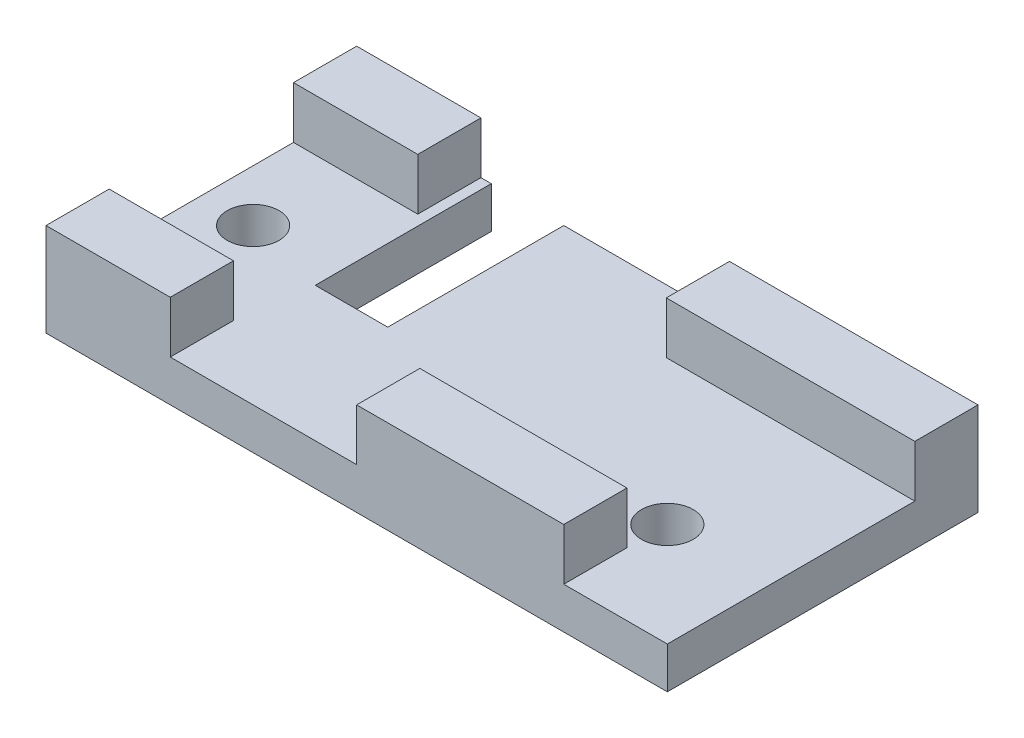
ISO-10303-21;
HEADER;
FILE_DESCRIPTION(('STEP AP214'),'2;1');
FILE_NAME('part.step','',(''),(''),'','','');
FILE_SCHEMA(('AUTOMOTIVE_DESIGN { 1 0 10303 214 1 1 1 1 }'));
ENDSEC;
DATA;
#1=APPLICATION_CONTEXT('core data for automotive mechanical design processes');
#2=APPLICATION_PROTOCOL_DEFINITION('international standard','automotive_design',2000,#1);
#3=PRODUCT_CONTEXT('',#1,'mechanical');
#4=PRODUCT('Part','Part','',(#3));
#5=PRODUCT_RELATED_PRODUCT_CATEGORY('part','',(#4));
#6=PRODUCT_DEFINITION_FORMATION('','',#4);
#7=PRODUCT_DEFINITION_CONTEXT('part definition',#1,'design');
#8=PRODUCT_DEFINITION('design','',#6,#7);
#9=PRODUCT_DEFINITION_SHAPE('','',#8);
#10=(LENGTH_UNIT() NAMED_UNIT(*) SI_UNIT(.MILLI.,.METRE.));
#11=(NAMED_UNIT(*) PLANE_ANGLE_UNIT() SI_UNIT($,.RADIAN.));
#12=(NAMED_UNIT(*) SI_UNIT($,.STERADIAN.) SOLID_ANGLE_UNIT());
#13=UNCERTAINTY_MEASURE_WITH_UNIT(LENGTH_MEASURE(1.E-05),#10,'distance_accuracy_value','');
#14=(GEOMETRIC_REPRESENTATION_CONTEXT(3) GLOBAL_UNCERTAINTY_ASSIGNED_CONTEXT((#13)) GLOBAL_UNIT_ASSIGNED_CONTEXT((#10,
#11,#12)) REPRESENTATION_CONTEXT('',''));
#15=CARTESIAN_POINT('',(0.,0.,0.));
#16=DIRECTION('',(0.,0.,1.));
#17=DIRECTION('',(1.,0.,0.));
#18=AXIS2_PLACEMENT_3D('',#15,#16,#17);
#19=CARTESIAN_POINT('',(-38.1,2.54,-19.05));
#20=DIRECTION('',(0.,0.,1.));
#21=DIRECTION('',(1.,0.,0.));
#22=AXIS2_PLACEMENT_3D('',#19,#20,#21);
#23=PLANE('',#22);
#24=DIRECTION('',(-1.,0.,0.));
#25=VECTOR('',#24,1.);
#26=CARTESIAN_POINT('',(-38.1,-2.54,-19.05));
#27=LINE('',#26,#25);
#28=CARTESIAN_POINT('',(38.1,-2.54,-19.05));
#29=VERTEX_POINT('',#28);
#30=CARTESIAN_POINT('',(-12.7,-2.54,-19.05));
#31=VERTEX_POINT('',#30);
#32=EDGE_CURVE('E251',#29,#31,#27,.T.);
#33=ORIENTED_EDGE('',*,*,#32,.T.);
#34=DIRECTION('',(0.,1.,0.));
#35=VECTOR('',#34,1.);
#36=CARTESIAN_POINT('',(-12.7,-2.54,-19.05));
#37=LINE('',#36,#35);
#38=CARTESIAN_POINT('',(-12.7,2.54,-19.05));
#39=VERTEX_POINT('',#38);
#40=EDGE_CURVE('E380',#31,#39,#37,.T.);
#41=ORIENTED_EDGE('',*,*,#40,.T.);
#42=DIRECTION('',(-1.,0.,0.));
#43=VECTOR('',#42,1.);
#44=CARTESIAN_POINT('',(-38.1,2.54,-19.05));
#45=LINE('',#44,#43);
#46=CARTESIAN_POINT('',(7.61999999999998,2.54,-19.05));
#47=VERTEX_POINT('',#46);
#48=EDGE_CURVE('E264',#47,#39,#45,.T.);
#49=ORIENTED_EDGE('',*,*,#48,.F.);
#50=DIRECTION('',(0.,-1.,0.));
#51=VECTOR('',#50,1.);
#52=CARTESIAN_POINT('',(7.62,47.7696348876889,-19.05));
#53=LINE('',#52,#51);
#54=CARTESIAN_POINT('',(7.62,8.89,-19.05));
#55=VERTEX_POINT('',#54);
#56=EDGE_CURVE('E307',#55,#47,#53,.T.);
#57=ORIENTED_EDGE('',*,*,#56,.F.);
#58=DIRECTION('',(1.,0.,0.));
#59=VECTOR('',#58,1.);
#60=CARTESIAN_POINT('',(0.,8.89,-19.05));
#61=LINE('',#60,#59);
#62=CARTESIAN_POINT('',(38.1,8.89000000000002,-19.05));
#63=VERTEX_POINT('',#62);
#64=EDGE_CURVE('E297',#55,#63,#61,.T.);
#65=ORIENTED_EDGE('',*,*,#64,.T.);
#66=DIRECTION('',(0.,-1.,0.));
#67=VECTOR('',#66,1.);
#68=CARTESIAN_POINT('',(38.1,2.54,-19.05));
#69=LINE('',#68,#67);
#70=EDGE_CURVE('E11',#63,#29,#69,.T.);
#71=ORIENTED_EDGE('',*,*,#70,.T.);
#72=EDGE_LOOP('',(#33,#41,#49,#57,#65,#71));
#73=FACE_BOUND('',#72,.T.);
#74=ADVANCED_FACE('F45',(#73),#23,.F.);
#75=CARTESIAN_POINT('',(38.1,2.54,19.05));
#76=DIRECTION('',(-1.,0.,0.));
#77=DIRECTION('',(0.,0.,1.));
#78=AXIS2_PLACEMENT_3D('',#75,#76,#77);
#79=PLANE('',#78);
#80=DIRECTION('',(0.,0.,-1.));
#81=VECTOR('',#80,1.);
#82=CARTESIAN_POINT('',(38.1,2.54,19.05));
#83=LINE('',#82,#81);
#84=CARTESIAN_POINT('',(38.1,2.54,19.05));
#85=VERTEX_POINT('',#84);
#86=CARTESIAN_POINT('',(38.1,2.54,-11.303));
#87=VERTEX_POINT('',#86);
#88=EDGE_CURVE('E188',#85,#87,#83,.T.);
#89=ORIENTED_EDGE('',*,*,#88,.F.);
#90=DIRECTION('',(0.,-1.,0.));
#91=VECTOR('',#90,1.);
#92=CARTESIAN_POINT('',(38.1,2.54,19.05));
#93=LINE('',#92,#91);
#94=CARTESIAN_POINT('',(38.1,-2.54,19.05));
#95=VERTEX_POINT('',#94);
#96=EDGE_CURVE('E192',#85,#95,#93,.T.);
#97=ORIENTED_EDGE('',*,*,#96,.T.);
#98=DIRECTION('',(0.,0.,-1.));
#99=VECTOR('',#98,1.);
#100=CARTESIAN_POINT('',(38.1,-2.54,19.05));
#101=LINE('',#100,#99);
#102=EDGE_CURVE('E257',#95,#29,#101,.T.);
#103=ORIENTED_EDGE('',*,*,#102,.T.);
#104=ORIENTED_EDGE('',*,*,#70,.F.);
#105=DIRECTION('',(0.,0.,1.));
#106=VECTOR('',#105,1.);
#107=CARTESIAN_POINT('',(38.1,8.89,0.));
#108=LINE('',#107,#106);
#109=CARTESIAN_POINT('',(38.1,8.89,-11.303));
#110=VERTEX_POINT('',#109);
#111=EDGE_CURVE('E301',#63,#110,#108,.T.);
#112=ORIENTED_EDGE('',*,*,#111,.T.);
#113=DIRECTION('',(0.,-1.,0.));
#114=VECTOR('',#113,1.);
#115=CARTESIAN_POINT('',(38.1,47.7696348876889,-11.303));
#116=LINE('',#115,#114);
#117=EDGE_CURVE('E196',#110,#87,#116,.T.);
#118=ORIENTED_EDGE('',*,*,#117,.T.);
#119=EDGE_LOOP('',(#89,#97,#103,#104,#112,#118));
#120=FACE_BOUND('',#119,.T.);
#121=ADVANCED_FACE('F47',(#120),#79,.F.);
#122=CARTESIAN_POINT('',(-21.59,2.54,-19.05));
#123=VERTEX_POINT('',#122);
#124=CARTESIAN_POINT('',(-22.86,2.54,-19.05));
#125=VERTEX_POINT('',#124);
#126=EDGE_CURVE('E201',#123,#125,#45,.T.);
#127=ORIENTED_EDGE('',*,*,#126,.F.);
#128=DIRECTION('',(0.,1.,0.));
#129=VECTOR('',#128,1.);
#130=CARTESIAN_POINT('',(-21.59,-2.54,-19.05));
#131=LINE('',#130,#129);
#132=CARTESIAN_POINT('',(-21.59,-2.54,-19.05));
#133=VERTEX_POINT('',#132);
#134=EDGE_CURVE('E384',#133,#123,#131,.T.);
#135=ORIENTED_EDGE('',*,*,#134,.F.);
#136=CARTESIAN_POINT('',(-38.1,-2.54,-19.05));
#137=VERTEX_POINT('',#136);
#138=EDGE_CURVE('E249',#133,#137,#27,.T.);
#139=ORIENTED_EDGE('',*,*,#138,.T.);
#140=DIRECTION('',(0.,-1.,0.));
#141=VECTOR('',#140,1.);
#142=CARTESIAN_POINT('',(-38.1,2.54,-19.05));
#143=LINE('',#142,#141);
#144=CARTESIAN_POINT('',(-38.1,8.89000000000002,-19.05));
#145=VERTEX_POINT('',#144);
#146=EDGE_CURVE('E54',#145,#137,#143,.T.);
#147=ORIENTED_EDGE('',*,*,#146,.F.);
#148=DIRECTION('',(1.,0.,0.));
#149=VECTOR('',#148,1.);
#150=CARTESIAN_POINT('',(0.,8.89,-19.05));
#151=LINE('',#150,#149);
#152=CARTESIAN_POINT('',(-22.86,8.89000000000001,-19.05));
#153=VERTEX_POINT('',#152);
#154=EDGE_CURVE('E269',#145,#153,#151,.T.);
#155=ORIENTED_EDGE('',*,*,#154,.T.);
#156=DIRECTION('',(0.,-1.,0.));
#157=VECTOR('',#156,1.);
#158=CARTESIAN_POINT('',(-22.86,47.7696348876889,-19.05));
#159=LINE('',#158,#157);
#160=EDGE_CURVE('E274',#153,#125,#159,.T.);
#161=ORIENTED_EDGE('',*,*,#160,.T.);
#162=EDGE_LOOP('',(#127,#135,#139,#147,#155,#161));
#163=FACE_BOUND('',#162,.T.);
#164=ADVANCED_FACE('F462',(#163),#23,.F.);
#165=CARTESIAN_POINT('',(-38.1,2.54,19.05));
#166=DIRECTION('',(1.,0.,0.));
#167=DIRECTION('',(0.,0.,-1.));
#168=AXIS2_PLACEMENT_3D('',#165,#166,#167);
#169=PLANE('',#168);
#170=DIRECTION('',(0.,0.,1.));
#171=VECTOR('',#170,1.);
#172=CARTESIAN_POINT('',(-38.1,-2.54,19.05));
#173=LINE('',#172,#171);
#174=CARTESIAN_POINT('',(-38.1,-2.54,19.05));
#175=VERTEX_POINT('',#174);
#176=EDGE_CURVE('E238',#137,#175,#173,.T.);
#177=ORIENTED_EDGE('',*,*,#176,.T.);
#178=DIRECTION('',(0.,-1.,0.));
#179=VECTOR('',#178,1.);
#180=CARTESIAN_POINT('',(-38.1,2.54,19.05));
#181=LINE('',#180,#179);
#182=CARTESIAN_POINT('',(-38.1,8.89000000000002,19.05));
#183=VERTEX_POINT('',#182);
#184=EDGE_CURVE('E222',#183,#175,#181,.T.);
#185=ORIENTED_EDGE('',*,*,#184,.F.);
#186=DIRECTION('',(0.,0.,-1.));
#187=VECTOR('',#186,1.);
#188=CARTESIAN_POINT('',(-38.1,8.89000000000001,0.));
#189=LINE('',#188,#187);
#190=CARTESIAN_POINT('',(-38.1,8.89000000000001,11.303));
#191=VERTEX_POINT('',#190);
#192=EDGE_CURVE('E353',#183,#191,#189,.T.);
#193=ORIENTED_EDGE('',*,*,#192,.T.);
#194=DIRECTION('',(0.,-1.,0.));
#195=VECTOR('',#194,1.);
#196=CARTESIAN_POINT('',(-38.1,47.7696348876889,11.303));
#197=LINE('',#196,#195);
#198=CARTESIAN_POINT('',(-38.1,2.54,11.303));
#199=VERTEX_POINT('',#198);
#200=EDGE_CURVE('E357',#191,#199,#197,.T.);
#201=ORIENTED_EDGE('',*,*,#200,.T.);
#202=DIRECTION('',(0.,0.,1.));
#203=VECTOR('',#202,1.);
#204=CARTESIAN_POINT('',(-38.1,2.54,19.05));
#205=LINE('',#204,#203);
#206=CARTESIAN_POINT('',(-38.1,2.54,-11.303));
#207=VERTEX_POINT('',#206);
#208=EDGE_CURVE('E228',#207,#199,#205,.T.);
#209=ORIENTED_EDGE('',*,*,#208,.F.);
#210=DIRECTION('',(0.,-1.,0.));
#211=VECTOR('',#210,1.);
#212=CARTESIAN_POINT('',(-38.1,47.7696348876889,-11.303));
#213=LINE('',#212,#211);
#214=CARTESIAN_POINT('',(-38.1,8.89000000000001,-11.303));
#215=VERTEX_POINT('',#214);
#216=EDGE_CURVE('E278',#215,#207,#213,.T.);
#217=ORIENTED_EDGE('',*,*,#216,.F.);
#218=DIRECTION('',(0.,0.,-1.));
#219=VECTOR('',#218,1.);
#220=CARTESIAN_POINT('',(-38.1,8.89000000000001,0.));
#221=LINE('',#220,#219);
#222=EDGE_CURVE('E240',#215,#145,#221,.T.);
#223=ORIENTED_EDGE('',*,*,#222,.T.);
#224=ORIENTED_EDGE('',*,*,#146,.T.);
#225=EDGE_LOOP('',(#177,#185,#193,#201,#209,#217,#223,#224));
#226=FACE_BOUND('',#225,.T.);
#227=ADVANCED_FACE('F237',(#226),#169,.F.);
#228=CARTESIAN_POINT('',(-38.1,2.54,19.05));
#229=DIRECTION('',(0.,0.,-1.));
#230=DIRECTION('',(-1.,0.,0.));
#231=AXIS2_PLACEMENT_3D('',#228,#229,#230);
#232=PLANE('',#231);
#233=DIRECTION('',(1.,0.,0.));
#234=VECTOR('',#233,1.);
#235=CARTESIAN_POINT('',(38.1,2.54,19.05));
#236=LINE('',#235,#234);
#237=CARTESIAN_POINT('',(25.4,2.54,19.05));
#238=VERTEX_POINT('',#237);
#239=EDGE_CURVE('E205',#238,#85,#236,.T.);
#240=ORIENTED_EDGE('',*,*,#239,.F.);
#241=DIRECTION('',(0.,-1.,0.));
#242=VECTOR('',#241,1.);
#243=CARTESIAN_POINT('',(25.4,8.89000000000001,19.05));
#244=LINE('',#243,#242);
#245=CARTESIAN_POINT('',(25.4,8.89000000000001,19.05));
#246=VERTEX_POINT('',#245);
#247=EDGE_CURVE('E215',#246,#238,#244,.T.);
#248=ORIENTED_EDGE('',*,*,#247,.F.);
#249=DIRECTION('',(-1.,0.,0.));
#250=VECTOR('',#249,1.);
#251=CARTESIAN_POINT('',(0.,8.89,19.05));
#252=LINE('',#251,#250);
#253=CARTESIAN_POINT('',(0.,8.89,19.05));
#254=VERTEX_POINT('',#253);
#255=EDGE_CURVE('E331',#246,#254,#252,.T.);
#256=ORIENTED_EDGE('',*,*,#255,.T.);
#257=DIRECTION('',(0.,-1.,0.));
#258=VECTOR('',#257,1.);
#259=CARTESIAN_POINT('',(0.,47.7696348876889,19.05));
#260=LINE('',#259,#258);
#261=CARTESIAN_POINT('',(0.,2.54,19.05));
#262=VERTEX_POINT('',#261);
#263=EDGE_CURVE('E337',#254,#262,#260,.T.);
#264=ORIENTED_EDGE('',*,*,#263,.T.);
#265=DIRECTION('',(1.,0.,0.));
#266=VECTOR('',#265,1.);
#267=CARTESIAN_POINT('',(-38.1,2.54,19.05));
#268=LINE('',#267,#266);
#269=CARTESIAN_POINT('',(-22.86,2.54,19.05));
#270=VERTEX_POINT('',#269);
#271=EDGE_CURVE('E223',#270,#262,#268,.T.);
#272=ORIENTED_EDGE('',*,*,#271,.F.);
#273=DIRECTION('',(0.,-1.,0.));
#274=VECTOR('',#273,1.);
#275=CARTESIAN_POINT('',(-22.86,47.7696348876889,19.05));
#276=LINE('',#275,#274);
#277=CARTESIAN_POINT('',(-22.86,8.89000000000001,19.05));
#278=VERTEX_POINT('',#277);
#279=EDGE_CURVE('E360',#278,#270,#276,.T.);
#280=ORIENTED_EDGE('',*,*,#279,.F.);
#281=DIRECTION('',(-1.,0.,0.));
#282=VECTOR('',#281,1.);
#283=CARTESIAN_POINT('',(0.,8.89,19.05));
#284=LINE('',#283,#282);
#285=EDGE_CURVE('E349',#278,#183,#284,.T.);
#286=ORIENTED_EDGE('',*,*,#285,.T.);
#287=ORIENTED_EDGE('',*,*,#184,.T.);
#288=DIRECTION('',(1.,0.,0.));
#289=VECTOR('',#288,1.);
#290=CARTESIAN_POINT('',(-38.1,-2.54,19.05));
#291=LINE('',#290,#289);
#292=EDGE_CURVE('E202',#175,#95,#291,.T.);
#293=ORIENTED_EDGE('',*,*,#292,.T.);
#294=ORIENTED_EDGE('',*,*,#96,.F.);
#295=EDGE_LOOP('',(#240,#248,#256,#264,#272,#280,#286,#287,#293,#294));
#296=FACE_BOUND('',#295,.T.);
#297=ADVANCED_FACE('F217',(#296),#232,.F.);
#298=CARTESIAN_POINT('',(0.,2.54,0.));
#299=DIRECTION('',(0.,-1.,0.));
#300=DIRECTION('',(0.,0.,-1.));
#301=AXIS2_PLACEMENT_3D('',#298,#299,#300);
#302=PLANE('',#301);
#303=CARTESIAN_POINT('',(25.4,2.54,6.35000000000001));
#304=DIRECTION('',(0.,-1.,0.));
#305=DIRECTION('',(0.,0.,-1.));
#306=AXIS2_PLACEMENT_3D('',#303,#304,#305);
#307=CIRCLE('',#306,3.175);
#308=CARTESIAN_POINT('',(25.4,2.54,3.175));
#309=VERTEX_POINT('',#308);
#310=EDGE_CURVE('E418',#309,#309,#307,.T.);
#311=ORIENTED_EDGE('',*,*,#310,.T.);
#312=EDGE_LOOP('',(#311));
#313=FACE_BOUND('',#312,.T.);
#314=CARTESIAN_POINT('',(-31.75,2.54,0.));
#315=DIRECTION('',(0.,-1.,0.));
#316=DIRECTION('',(0.,0.,-1.));
#317=AXIS2_PLACEMENT_3D('',#314,#315,#316);
#318=CIRCLE('',#317,3.175);
#319=CARTESIAN_POINT('',(-31.75,2.54,-3.17499999999999));
#320=VERTEX_POINT('',#319);
#321=EDGE_CURVE('E423',#320,#320,#318,.T.);
#322=ORIENTED_EDGE('',*,*,#321,.T.);
#323=EDGE_LOOP('',(#322));
#324=FACE_BOUND('',#323,.T.);
#325=ORIENTED_EDGE('',*,*,#48,.T.);
#326=DIRECTION('',(0.,0.,-1.));
#327=VECTOR('',#326,1.);
#328=CARTESIAN_POINT('',(-12.7,2.54,-19.05));
#329=LINE('',#328,#327);
#330=CARTESIAN_POINT('',(-12.7,2.54,2.54));
#331=VERTEX_POINT('',#330);
#332=EDGE_CURVE('E401',#331,#39,#329,.T.);
#333=ORIENTED_EDGE('',*,*,#332,.F.);
#334=DIRECTION('',(1.,0.,0.));
#335=VECTOR('',#334,1.);
#336=CARTESIAN_POINT('',(-12.7,2.54,2.54));
#337=LINE('',#336,#335);
#338=CARTESIAN_POINT('',(-21.59,2.54,2.54));
#339=VERTEX_POINT('',#338);
#340=EDGE_CURVE('E392',#339,#331,#337,.T.);
#341=ORIENTED_EDGE('',*,*,#340,.F.);
#342=DIRECTION('',(0.,0.,1.));
#343=VECTOR('',#342,1.);
#344=CARTESIAN_POINT('',(-21.59,2.54,-19.05));
#345=LINE('',#344,#343);
#346=EDGE_CURVE('E397',#123,#339,#345,.T.);
#347=ORIENTED_EDGE('',*,*,#346,.F.);
#348=ORIENTED_EDGE('',*,*,#126,.T.);
#349=DIRECTION('',(0.,0.,1.));
#350=VECTOR('',#349,1.);
#351=CARTESIAN_POINT('',(-22.86,2.54,0.));
#352=LINE('',#351,#350);
#353=CARTESIAN_POINT('',(-22.86,2.54,-11.303));
#354=VERTEX_POINT('',#353);
#355=EDGE_CURVE('E281',#125,#354,#352,.T.);
#356=ORIENTED_EDGE('',*,*,#355,.T.);
#357=DIRECTION('',(-1.,0.,0.));
#358=VECTOR('',#357,1.);
#359=CARTESIAN_POINT('',(0.,2.54,-11.303));
#360=LINE('',#359,#358);
#361=EDGE_CURVE('E285',#354,#207,#360,.T.);
#362=ORIENTED_EDGE('',*,*,#361,.T.);
#363=ORIENTED_EDGE('',*,*,#208,.T.);
#364=DIRECTION('',(1.,0.,0.));
#365=VECTOR('',#364,1.);
#366=CARTESIAN_POINT('',(0.,2.54,11.303));
#367=LINE('',#366,#365);
#368=CARTESIAN_POINT('',(-22.86,2.54,11.303));
#369=VERTEX_POINT('',#368);
#370=EDGE_CURVE('E363',#199,#369,#367,.T.);
#371=ORIENTED_EDGE('',*,*,#370,.T.);
#372=DIRECTION('',(0.,0.,1.));
#373=VECTOR('',#372,1.);
#374=CARTESIAN_POINT('',(-22.86,2.54,0.));
#375=LINE('',#374,#373);
#376=EDGE_CURVE('E367',#369,#270,#375,.T.);
#377=ORIENTED_EDGE('',*,*,#376,.T.);
#378=ORIENTED_EDGE('',*,*,#271,.T.);
#379=DIRECTION('',(0.,0.,-1.));
#380=VECTOR('',#379,1.);
#381=CARTESIAN_POINT('',(0.,2.54,0.));
#382=LINE('',#381,#380);
#383=CARTESIAN_POINT('',(0.,2.54,11.303));
#384=VERTEX_POINT('',#383);
#385=EDGE_CURVE('E341',#262,#384,#382,.T.);
#386=ORIENTED_EDGE('',*,*,#385,.T.);
#387=DIRECTION('',(1.,0.,0.));
#388=VECTOR('',#387,1.);
#389=CARTESIAN_POINT('',(0.,2.54,11.303));
#390=LINE('',#389,#388);
#391=CARTESIAN_POINT('',(25.4,2.54,11.303));
#392=VERTEX_POINT('',#391);
#393=EDGE_CURVE('E345',#384,#392,#390,.T.);
#394=ORIENTED_EDGE('',*,*,#393,.T.);
#395=DIRECTION('',(0.,0.,1.));
#396=VECTOR('',#395,1.);
#397=CARTESIAN_POINT('',(25.4,2.54,-2.89603165712366));
#398=LINE('',#397,#396);
#399=EDGE_CURVE('E209',#392,#238,#398,.T.);
#400=ORIENTED_EDGE('',*,*,#399,.T.);
#401=ORIENTED_EDGE('',*,*,#239,.T.);
#402=ORIENTED_EDGE('',*,*,#88,.T.);
#403=DIRECTION('',(-1.,0.,0.));
#404=VECTOR('',#403,1.);
#405=CARTESIAN_POINT('',(0.,2.54,-11.303));
#406=LINE('',#405,#404);
#407=CARTESIAN_POINT('',(7.62,2.54,-11.303));
#408=VERTEX_POINT('',#407);
#409=EDGE_CURVE('E310',#87,#408,#406,.T.);
#410=ORIENTED_EDGE('',*,*,#409,.T.);
#411=DIRECTION('',(0.,0.,-1.));
#412=VECTOR('',#411,1.);
#413=CARTESIAN_POINT('',(7.62,2.54,0.));
#414=LINE('',#413,#412);
#415=EDGE_CURVE('E313',#408,#47,#414,.T.);
#416=ORIENTED_EDGE('',*,*,#415,.T.);
#417=EDGE_LOOP('',(#325,#333,#341,#347,#348,#356,#362,#363,#371,#377,#378,#386,#394,#400,#401,
#402,#410,#416));
#418=FACE_BOUND('',#417,.T.);
#419=ADVANCED_FACE('F207',(#313,#324,#418),#302,.F.);
#420=CARTESIAN_POINT('',(0.,-2.54,0.));
#421=DIRECTION('',(0.,-1.,0.));
#422=DIRECTION('',(0.,0.,-1.));
#423=AXIS2_PLACEMENT_3D('',#420,#421,#422);
#424=PLANE('',#423);
#425=CARTESIAN_POINT('',(25.4,-2.54,6.35000000000001));
#426=DIRECTION('',(0.,-1.,0.));
#427=DIRECTION('',(0.,0.,-1.));
#428=AXIS2_PLACEMENT_3D('',#425,#426,#427);
#429=CIRCLE('',#428,3.175);
#430=CARTESIAN_POINT('',(25.4,-2.54,3.175));
#431=VERTEX_POINT('',#430);
#432=EDGE_CURVE('E427',#431,#431,#429,.T.);
#433=ORIENTED_EDGE('',*,*,#432,.F.);
#434=EDGE_LOOP('',(#433));
#435=FACE_BOUND('',#434,.T.);
#436=CARTESIAN_POINT('',(-31.75,-2.54,0.));
#437=DIRECTION('',(0.,-1.,0.));
#438=DIRECTION('',(0.,0.,-1.));
#439=AXIS2_PLACEMENT_3D('',#436,#437,#438);
#440=CIRCLE('',#439,3.175);
#441=CARTESIAN_POINT('',(-31.75,-2.54,-3.17499999999999));
#442=VERTEX_POINT('',#441);
#443=EDGE_CURVE('E428',#442,#442,#440,.T.);
#444=ORIENTED_EDGE('',*,*,#443,.F.);
#445=EDGE_LOOP('',(#444));
#446=FACE_BOUND('',#445,.T.);
#447=DIRECTION('',(0.,0.,-1.));
#448=VECTOR('',#447,1.);
#449=CARTESIAN_POINT('',(-12.7,-2.54,-19.05));
#450=LINE('',#449,#448);
#451=CARTESIAN_POINT('',(-12.7,-2.54,2.54));
#452=VERTEX_POINT('',#451);
#453=EDGE_CURVE('E396',#452,#31,#450,.T.);
#454=ORIENTED_EDGE('',*,*,#453,.T.);
#455=ORIENTED_EDGE('',*,*,#32,.F.);
#456=ORIENTED_EDGE('',*,*,#102,.F.);
#457=ORIENTED_EDGE('',*,*,#292,.F.);
#458=ORIENTED_EDGE('',*,*,#176,.F.);
#459=ORIENTED_EDGE('',*,*,#138,.F.);
#460=DIRECTION('',(0.,0.,1.));
#461=VECTOR('',#460,1.);
#462=CARTESIAN_POINT('',(-21.59,-2.54,-19.05));
#463=LINE('',#462,#461);
#464=CARTESIAN_POINT('',(-21.59,-2.54,2.54));
#465=VERTEX_POINT('',#464);
#466=EDGE_CURVE('E406',#133,#465,#463,.T.);
#467=ORIENTED_EDGE('',*,*,#466,.T.);
#468=DIRECTION('',(1.,0.,0.));
#469=VECTOR('',#468,1.);
#470=CARTESIAN_POINT('',(-12.7,-2.54,2.54));
#471=LINE('',#470,#469);
#472=EDGE_CURVE('E69',#465,#452,#471,.T.);
#473=ORIENTED_EDGE('',*,*,#472,.T.);
#474=EDGE_LOOP('',(#454,#455,#456,#457,#458,#459,#467,#473));
#475=FACE_BOUND('',#474,.T.);
#476=ADVANCED_FACE('F247',(#435,#446,#475),#424,.T.);
#477=CARTESIAN_POINT('',(-22.86,47.7696348876889,0.));
#478=DIRECTION('',(1.,0.,0.));
#479=DIRECTION('',(0.,0.,-1.));
#480=AXIS2_PLACEMENT_3D('',#477,#478,#479);
#481=PLANE('',#480);
#482=DIRECTION('',(0.,0.,-1.));
#483=VECTOR('',#482,1.);
#484=CARTESIAN_POINT('',(-22.86,8.89,0.));
#485=LINE('',#484,#483);
#486=CARTESIAN_POINT('',(-22.86,8.89,-11.303));
#487=VERTEX_POINT('',#486);
#488=EDGE_CURVE('E292',#487,#153,#485,.T.);
#489=ORIENTED_EDGE('',*,*,#488,.F.);
#490=DIRECTION('',(0.,-1.,0.));
#491=VECTOR('',#490,1.);
#492=CARTESIAN_POINT('',(-22.86,47.7696348876889,-11.303));
#493=LINE('',#492,#491);
#494=EDGE_CURVE('E270',#487,#354,#493,.T.);
#495=ORIENTED_EDGE('',*,*,#494,.T.);
#496=ORIENTED_EDGE('',*,*,#355,.F.);
#497=ORIENTED_EDGE('',*,*,#160,.F.);
#498=EDGE_LOOP('',(#489,#495,#496,#497));
#499=FACE_BOUND('',#498,.T.);
#500=ADVANCED_FACE('F441',(#499),#481,.T.);
#501=CARTESIAN_POINT('',(0.,47.7696348876889,-11.303));
#502=DIRECTION('',(0.,0.,1.));
#503=DIRECTION('',(1.,0.,0.));
#504=AXIS2_PLACEMENT_3D('',#501,#502,#503);
#505=PLANE('',#504);
#506=DIRECTION('',(1.,0.,0.));
#507=VECTOR('',#506,1.);
#508=CARTESIAN_POINT('',(0.,8.89,-11.303));
#509=LINE('',#508,#507);
#510=EDGE_CURVE('E259',#215,#487,#509,.T.);
#511=ORIENTED_EDGE('',*,*,#510,.F.);
#512=ORIENTED_EDGE('',*,*,#216,.T.);
#513=ORIENTED_EDGE('',*,*,#361,.F.);
#514=ORIENTED_EDGE('',*,*,#494,.F.);
#515=EDGE_LOOP('',(#511,#512,#513,#514));
#516=FACE_BOUND('',#515,.T.);
#517=ADVANCED_FACE('F509',(#516),#505,.T.);
#518=CARTESIAN_POINT('',(0.,8.89000000000001,0.));
#519=DIRECTION('',(0.,-1.,0.));
#520=DIRECTION('',(1.,0.,0.));
#521=AXIS2_PLACEMENT_3D('',#518,#519,#520);
#522=PLANE('',#521);
#523=ORIENTED_EDGE('',*,*,#510,.T.);
#524=ORIENTED_EDGE('',*,*,#488,.T.);
#525=ORIENTED_EDGE('',*,*,#154,.F.);
#526=ORIENTED_EDGE('',*,*,#222,.F.);
#527=EDGE_LOOP('',(#523,#524,#525,#526));
#528=FACE_BOUND('',#527,.T.);
#529=ADVANCED_FACE('F504',(#528),#522,.F.);
#530=CARTESIAN_POINT('',(0.,47.7696348876889,-11.303));
#531=DIRECTION('',(0.,0.,1.));
#532=DIRECTION('',(1.,0.,0.));
#533=AXIS2_PLACEMENT_3D('',#530,#531,#532);
#534=PLANE('',#533);
#535=DIRECTION('',(1.,0.,0.));
#536=VECTOR('',#535,1.);
#537=CARTESIAN_POINT('',(0.,8.89,-11.303));
#538=LINE('',#537,#536);
#539=CARTESIAN_POINT('',(7.62,8.89,-11.303));
#540=VERTEX_POINT('',#539);
#541=EDGE_CURVE('E320',#540,#110,#538,.T.);
#542=ORIENTED_EDGE('',*,*,#541,.F.);
#543=DIRECTION('',(0.,-1.,0.));
#544=VECTOR('',#543,1.);
#545=CARTESIAN_POINT('',(7.62,47.7696348876889,-11.303));
#546=LINE('',#545,#544);
#547=EDGE_CURVE('E302',#540,#408,#546,.T.);
#548=ORIENTED_EDGE('',*,*,#547,.T.);
#549=ORIENTED_EDGE('',*,*,#409,.F.);
#550=ORIENTED_EDGE('',*,*,#117,.F.);
#551=EDGE_LOOP('',(#542,#548,#549,#550));
#552=FACE_BOUND('',#551,.T.);
#553=ADVANCED_FACE('F492',(#552),#534,.T.);
#554=CARTESIAN_POINT('',(7.62,47.7696348876889,0.));
#555=DIRECTION('',(-1.,0.,0.));
#556=DIRECTION('',(0.,0.,1.));
#557=AXIS2_PLACEMENT_3D('',#554,#555,#556);
#558=PLANE('',#557);
#559=DIRECTION('',(0.,0.,1.));
#560=VECTOR('',#559,1.);
#561=CARTESIAN_POINT('',(7.62,8.89,0.));
#562=LINE('',#561,#560);
#563=EDGE_CURVE('E289',#55,#540,#562,.T.);
#564=ORIENTED_EDGE('',*,*,#563,.F.);
#565=ORIENTED_EDGE('',*,*,#56,.T.);
#566=ORIENTED_EDGE('',*,*,#415,.F.);
#567=ORIENTED_EDGE('',*,*,#547,.F.);
#568=EDGE_LOOP('',(#564,#565,#566,#567));
#569=FACE_BOUND('',#568,.T.);
#570=ADVANCED_FACE('F495',(#569),#558,.T.);
#571=CARTESIAN_POINT('',(0.,8.89000000000001,0.));
#572=DIRECTION('',(0.,-1.,0.));
#573=DIRECTION('',(1.,0.,0.));
#574=AXIS2_PLACEMENT_3D('',#571,#572,#573);
#575=PLANE('',#574);
#576=ORIENTED_EDGE('',*,*,#563,.T.);
#577=ORIENTED_EDGE('',*,*,#541,.T.);
#578=ORIENTED_EDGE('',*,*,#111,.F.);
#579=ORIENTED_EDGE('',*,*,#64,.F.);
#580=EDGE_LOOP('',(#576,#577,#578,#579));
#581=FACE_BOUND('',#580,.T.);
#582=ADVANCED_FACE('F487',(#581),#575,.F.);
#583=CARTESIAN_POINT('',(0.,47.7696348876889,0.));
#584=DIRECTION('',(-1.,0.,0.));
#585=DIRECTION('',(0.,0.,1.));
#586=AXIS2_PLACEMENT_3D('',#583,#584,#585);
#587=PLANE('',#586);
#588=DIRECTION('',(0.,0.,1.));
#589=VECTOR('',#588,1.);
#590=CARTESIAN_POINT('',(0.,8.89,0.));
#591=LINE('',#590,#589);
#592=CARTESIAN_POINT('',(0.,8.89000000000001,11.303));
#593=VERTEX_POINT('',#592);
#594=EDGE_CURVE('E327',#593,#254,#591,.T.);
#595=ORIENTED_EDGE('',*,*,#594,.F.);
#596=DIRECTION('',(0.,-1.,0.));
#597=VECTOR('',#596,1.);
#598=CARTESIAN_POINT('',(0.,47.7696348876889,11.303));
#599=LINE('',#598,#597);
#600=EDGE_CURVE('E334',#593,#384,#599,.T.);
#601=ORIENTED_EDGE('',*,*,#600,.T.);
#602=ORIENTED_EDGE('',*,*,#385,.F.);
#603=ORIENTED_EDGE('',*,*,#263,.F.);
#604=EDGE_LOOP('',(#595,#601,#602,#603));
#605=FACE_BOUND('',#604,.T.);
#606=ADVANCED_FACE('F502',(#605),#587,.T.);
#607=CARTESIAN_POINT('',(0.,47.7696348876889,11.303));
#608=DIRECTION('',(0.,0.,-1.));
#609=DIRECTION('',(-1.,0.,0.));
#610=AXIS2_PLACEMENT_3D('',#607,#608,#609);
#611=PLANE('',#610);
#612=DIRECTION('',(0.,-1.,0.));
#613=VECTOR('',#612,1.);
#614=CARTESIAN_POINT('',(25.4,8.89000000000001,11.303));
#615=LINE('',#614,#613);
#616=CARTESIAN_POINT('',(25.4,8.89,11.303));
#617=VERTEX_POINT('',#616);
#618=EDGE_CURVE('E61',#617,#392,#615,.T.);
#619=ORIENTED_EDGE('',*,*,#618,.T.);
#620=ORIENTED_EDGE('',*,*,#393,.F.);
#621=ORIENTED_EDGE('',*,*,#600,.F.);
#622=DIRECTION('',(-1.,0.,0.));
#623=VECTOR('',#622,1.);
#624=CARTESIAN_POINT('',(0.,8.89,11.303));
#625=LINE('',#624,#623);
#626=EDGE_CURVE('E317',#617,#593,#625,.T.);
#627=ORIENTED_EDGE('',*,*,#626,.F.);
#628=EDGE_LOOP('',(#619,#620,#621,#627));
#629=FACE_BOUND('',#628,.T.);
#630=ADVANCED_FACE('F541',(#629),#611,.T.);
#631=CARTESIAN_POINT('',(0.,8.89000000000001,0.));
#632=DIRECTION('',(0.,-1.,0.));
#633=DIRECTION('',(1.,0.,0.));
#634=AXIS2_PLACEMENT_3D('',#631,#632,#633);
#635=PLANE('',#634);
#636=ORIENTED_EDGE('',*,*,#255,.F.);
#637=DIRECTION('',(0.,0.,1.));
#638=VECTOR('',#637,1.);
#639=CARTESIAN_POINT('',(25.4,8.89000000000001,-2.89603165712366));
#640=LINE('',#639,#638);
#641=EDGE_CURVE('E214',#617,#246,#640,.T.);
#642=ORIENTED_EDGE('',*,*,#641,.F.);
#643=ORIENTED_EDGE('',*,*,#626,.T.);
#644=ORIENTED_EDGE('',*,*,#594,.T.);
#645=EDGE_LOOP('',(#636,#642,#643,#644));
#646=FACE_BOUND('',#645,.T.);
#647=ADVANCED_FACE('F544',(#646),#635,.F.);
#648=CARTESIAN_POINT('',(0.,47.7696348876889,11.303));
#649=DIRECTION('',(0.,0.,-1.));
#650=DIRECTION('',(-1.,0.,0.));
#651=AXIS2_PLACEMENT_3D('',#648,#649,#650);
#652=PLANE('',#651);
#653=DIRECTION('',(-1.,0.,0.));
#654=VECTOR('',#653,1.);
#655=CARTESIAN_POINT('',(0.,8.89,11.303));
#656=LINE('',#655,#654);
#657=CARTESIAN_POINT('',(-22.86,8.89000000000001,11.303));
#658=VERTEX_POINT('',#657);
#659=EDGE_CURVE('E374',#658,#191,#656,.T.);
#660=ORIENTED_EDGE('',*,*,#659,.F.);
#661=DIRECTION('',(0.,-1.,0.));
#662=VECTOR('',#661,1.);
#663=CARTESIAN_POINT('',(-22.86,47.7696348876889,11.303));
#664=LINE('',#663,#662);
#665=EDGE_CURVE('E354',#658,#369,#664,.T.);
#666=ORIENTED_EDGE('',*,*,#665,.T.);
#667=ORIENTED_EDGE('',*,*,#370,.F.);
#668=ORIENTED_EDGE('',*,*,#200,.F.);
#669=EDGE_LOOP('',(#660,#666,#667,#668));
#670=FACE_BOUND('',#669,.T.);
#671=ADVANCED_FACE('F527',(#670),#652,.T.);
#672=CARTESIAN_POINT('',(-22.86,47.7696348876889,0.));
#673=DIRECTION('',(1.,0.,0.));
#674=DIRECTION('',(0.,0.,-1.));
#675=AXIS2_PLACEMENT_3D('',#672,#673,#674);
#676=PLANE('',#675);
#677=DIRECTION('',(0.,0.,-1.));
#678=VECTOR('',#677,1.);
#679=CARTESIAN_POINT('',(-22.86,8.89,0.));
#680=LINE('',#679,#678);
#681=EDGE_CURVE('E348',#278,#658,#680,.T.);
#682=ORIENTED_EDGE('',*,*,#681,.F.);
#683=ORIENTED_EDGE('',*,*,#279,.T.);
#684=ORIENTED_EDGE('',*,*,#376,.F.);
#685=ORIENTED_EDGE('',*,*,#665,.F.);
#686=EDGE_LOOP('',(#682,#683,#684,#685));
#687=FACE_BOUND('',#686,.T.);
#688=ADVANCED_FACE('F531',(#687),#676,.T.);
#689=CARTESIAN_POINT('',(0.,8.89000000000001,0.));
#690=DIRECTION('',(0.,-1.,0.));
#691=DIRECTION('',(1.,0.,0.));
#692=AXIS2_PLACEMENT_3D('',#689,#690,#691);
#693=PLANE('',#692);
#694=ORIENTED_EDGE('',*,*,#681,.T.);
#695=ORIENTED_EDGE('',*,*,#659,.T.);
#696=ORIENTED_EDGE('',*,*,#192,.F.);
#697=ORIENTED_EDGE('',*,*,#285,.F.);
#698=EDGE_LOOP('',(#694,#695,#696,#697));
#699=FACE_BOUND('',#698,.T.);
#700=ADVANCED_FACE('F559',(#699),#693,.F.);
#701=CARTESIAN_POINT('',(-12.7,-2.54,-19.05));
#702=DIRECTION('',(1.,0.,0.));
#703=DIRECTION('',(0.,0.,-1.));
#704=AXIS2_PLACEMENT_3D('',#701,#702,#703);
#705=PLANE('',#704);
#706=ORIENTED_EDGE('',*,*,#332,.T.);
#707=ORIENTED_EDGE('',*,*,#40,.F.);
#708=ORIENTED_EDGE('',*,*,#453,.F.);
#709=DIRECTION('',(0.,1.,0.));
#710=VECTOR('',#709,1.);
#711=CARTESIAN_POINT('',(-12.7,-2.54,2.54));
#712=LINE('',#711,#710);
#713=EDGE_CURVE('E371',#452,#331,#712,.T.);
#714=ORIENTED_EDGE('',*,*,#713,.T.);
#715=EDGE_LOOP('',(#706,#707,#708,#714));
#716=FACE_BOUND('',#715,.T.);
#717=ADVANCED_FACE('F555',(#716),#705,.F.);
#718=CARTESIAN_POINT('',(-12.7,-2.54,2.54));
#719=DIRECTION('',(0.,0.,1.));
#720=DIRECTION('',(1.,0.,0.));
#721=AXIS2_PLACEMENT_3D('',#718,#719,#720);
#722=PLANE('',#721);
#723=ORIENTED_EDGE('',*,*,#340,.T.);
#724=ORIENTED_EDGE('',*,*,#713,.F.);
#725=ORIENTED_EDGE('',*,*,#472,.F.);
#726=DIRECTION('',(0.,1.,0.));
#727=VECTOR('',#726,1.);
#728=CARTESIAN_POINT('',(-21.59,-2.54,2.54));
#729=LINE('',#728,#727);
#730=EDGE_CURVE('E387',#465,#339,#729,.T.);
#731=ORIENTED_EDGE('',*,*,#730,.T.);
#732=EDGE_LOOP('',(#723,#724,#725,#731));
#733=FACE_BOUND('',#732,.T.);
#734=ADVANCED_FACE('F550',(#733),#722,.F.);
#735=CARTESIAN_POINT('',(-21.59,-2.54,-19.05));
#736=DIRECTION('',(-1.,0.,0.));
#737=DIRECTION('',(0.,0.,1.));
#738=AXIS2_PLACEMENT_3D('',#735,#736,#737);
#739=PLANE('',#738);
#740=ORIENTED_EDGE('',*,*,#346,.T.);
#741=ORIENTED_EDGE('',*,*,#730,.F.);
#742=ORIENTED_EDGE('',*,*,#466,.F.);
#743=ORIENTED_EDGE('',*,*,#134,.T.);
#744=EDGE_LOOP('',(#740,#741,#742,#743));
#745=FACE_BOUND('',#744,.T.);
#746=ADVANCED_FACE('F480',(#745),#739,.F.);
#747=CARTESIAN_POINT('',(25.4,8.89000000000001,-2.89603165712366));
#748=DIRECTION('',(-1.,0.,0.));
#749=DIRECTION('',(0.,0.,1.));
#750=AXIS2_PLACEMENT_3D('',#747,#748,#749);
#751=PLANE('',#750);
#752=ORIENTED_EDGE('',*,*,#641,.T.);
#753=ORIENTED_EDGE('',*,*,#247,.T.);
#754=ORIENTED_EDGE('',*,*,#399,.F.);
#755=ORIENTED_EDGE('',*,*,#618,.F.);
#756=EDGE_LOOP('',(#752,#753,#754,#755));
#757=FACE_BOUND('',#756,.T.);
#758=ADVANCED_FACE('F448',(#757),#751,.F.);
#759=CARTESIAN_POINT('',(-31.75,8.89000000000002,0.));
#760=DIRECTION('',(0.,-1.,0.));
#761=DIRECTION('',(0.,0.,-1.));
#762=AXIS2_PLACEMENT_3D('',#759,#760,#761);
#763=CYLINDRICAL_SURFACE('',#762,3.175);
#764=ORIENTED_EDGE('',*,*,#443,.T.);
#765=EDGE_LOOP('',(#764));
#766=FACE_BOUND('',#765,.T.);
#767=ORIENTED_EDGE('',*,*,#321,.F.);
#768=EDGE_LOOP('',(#767));
#769=FACE_BOUND('',#768,.T.);
#770=ADVANCED_FACE('F445',(#766,#769),#763,.F.);
#771=CARTESIAN_POINT('',(25.4,8.89000000000002,6.35000000000001));
#772=DIRECTION('',(0.,-1.,0.));
#773=DIRECTION('',(0.,0.,-1.));
#774=AXIS2_PLACEMENT_3D('',#771,#772,#773);
#775=CYLINDRICAL_SURFACE('',#774,3.175);
#776=ORIENTED_EDGE('',*,*,#432,.T.);
#777=EDGE_LOOP('',(#776));
#778=FACE_BOUND('',#777,.T.);
#779=ORIENTED_EDGE('',*,*,#310,.F.);
#780=EDGE_LOOP('',(#779));
#781=FACE_BOUND('',#780,.T.);
#782=ADVANCED_FACE('F436',(#778,#781),#775,.F.);
#783=CLOSED_SHELL('',(#74,#121,#164,#227,#297,#419,#476,#500,#517,#529,#553,#570,#582,#606,#630,
#647,#671,#688,#700,#717,#734,#746,#758,#770,#782));
#784=MANIFOLD_SOLID_BREP('B2',#783);
#785=ADVANCED_BREP_SHAPE_REPRESENTATION('',(#18,#784),#14);
#786=SHAPE_DEFINITION_REPRESENTATION(#9,#785);
ENDSEC;
END-ISO-10303-21;
